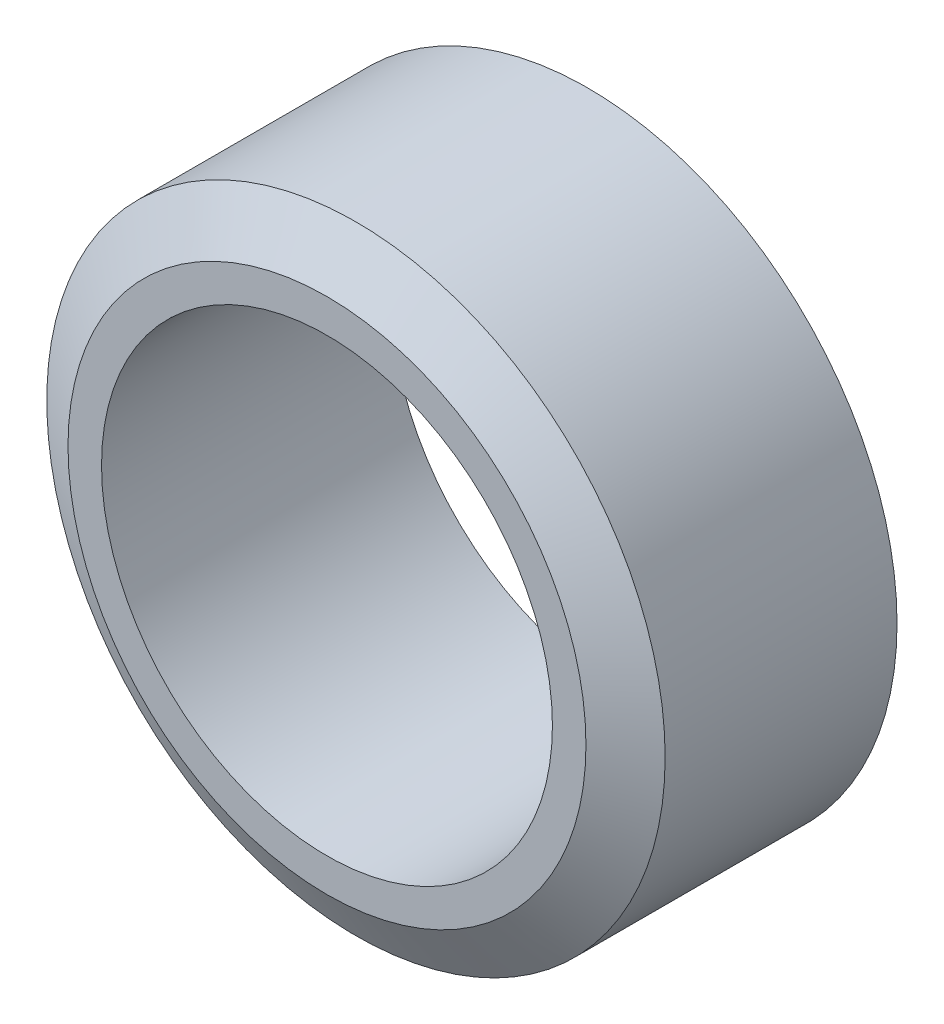
ISO-10303-21;
HEADER;
FILE_DESCRIPTION(('STEP AP214'),'2;1');
FILE_NAME('part.step','',(''),(''),'','','');
FILE_SCHEMA(('AUTOMOTIVE_DESIGN { 1 0 10303 214 1 1 1 1 }'));
ENDSEC;
DATA;
#1=APPLICATION_CONTEXT('core data for automotive mechanical design processes');
#2=APPLICATION_PROTOCOL_DEFINITION('international standard','automotive_design',2000,#1);
#3=PRODUCT_CONTEXT('',#1,'mechanical');
#4=PRODUCT('Part','Part','',(#3));
#5=PRODUCT_RELATED_PRODUCT_CATEGORY('part','',(#4));
#6=PRODUCT_DEFINITION_FORMATION('','',#4);
#7=PRODUCT_DEFINITION_CONTEXT('part definition',#1,'design');
#8=PRODUCT_DEFINITION('design','',#6,#7);
#9=PRODUCT_DEFINITION_SHAPE('','',#8);
#10=(LENGTH_UNIT() NAMED_UNIT(*) SI_UNIT(.MILLI.,.METRE.));
#11=(NAMED_UNIT(*) PLANE_ANGLE_UNIT() SI_UNIT($,.RADIAN.));
#12=(NAMED_UNIT(*) SI_UNIT($,.STERADIAN.) SOLID_ANGLE_UNIT());
#13=UNCERTAINTY_MEASURE_WITH_UNIT(LENGTH_MEASURE(1.E-05),#10,'distance_accuracy_value','');
#14=(GEOMETRIC_REPRESENTATION_CONTEXT(3) GLOBAL_UNCERTAINTY_ASSIGNED_CONTEXT((#13)) GLOBAL_UNIT_ASSIGNED_CONTEXT((#10,
#11,#12)) REPRESENTATION_CONTEXT('',''));
#15=CARTESIAN_POINT('',(0.,0.,0.));
#16=DIRECTION('',(0.,0.,1.));
#17=DIRECTION('',(1.,0.,0.));
#18=AXIS2_PLACEMENT_3D('',#15,#16,#17);
#19=CARTESIAN_POINT('',(0.,0.,9.));
#20=DIRECTION('',(0.,0.,1.));
#21=DIRECTION('',(1.,0.,0.));
#22=AXIS2_PLACEMENT_3D('',#19,#20,#21);
#23=PLANE('',#22);
#24=CARTESIAN_POINT('',(0.,0.,9.));
#25=DIRECTION('',(0.,0.,1.));
#26=DIRECTION('',(1.,0.,0.));
#27=AXIS2_PLACEMENT_3D('',#24,#25,#26);
#28=CIRCLE('',#27,8.041154273188);
#29=CARTESIAN_POINT('',(8.041154273188,0.,9.));
#30=VERTEX_POINT('',#29);
#31=EDGE_CURVE('E46',#30,#30,#28,.T.);
#32=ORIENTED_EDGE('',*,*,#31,.T.);
#33=EDGE_LOOP('',(#32));
#34=FACE_BOUND('',#33,.T.);
#35=CARTESIAN_POINT('',(0.,0.,9.));
#36=DIRECTION('',(0.,0.,1.));
#37=DIRECTION('',(1.,0.,0.));
#38=AXIS2_PLACEMENT_3D('',#35,#36,#37);
#39=CIRCLE('',#38,7.);
#40=CARTESIAN_POINT('',(7.,0.,9.));
#41=VERTEX_POINT('',#40);
#42=EDGE_CURVE('E51',#41,#41,#39,.T.);
#43=ORIENTED_EDGE('',*,*,#42,.F.);
#44=EDGE_LOOP('',(#43));
#45=FACE_BOUND('',#44,.T.);
#46=ADVANCED_FACE('F31',(#34,#45),#23,.T.);
#47=CARTESIAN_POINT('',(0.,0.,0.));
#48=DIRECTION('',(0.,0.,1.));
#49=DIRECTION('',(1.,0.,0.));
#50=AXIS2_PLACEMENT_3D('',#47,#48,#49);
#51=PLANE('',#50);
#52=CARTESIAN_POINT('',(0.,0.,0.));
#53=DIRECTION('',(0.,0.,1.));
#54=DIRECTION('',(1.,0.,0.));
#55=AXIS2_PLACEMENT_3D('',#52,#53,#54);
#56=CIRCLE('',#55,8.04115427318801);
#57=CARTESIAN_POINT('',(8.04115427318801,0.,0.));
#58=VERTEX_POINT('',#57);
#59=EDGE_CURVE('E10',#58,#58,#56,.F.);
#60=ORIENTED_EDGE('',*,*,#59,.T.);
#61=EDGE_LOOP('',(#60));
#62=FACE_BOUND('',#61,.T.);
#63=CARTESIAN_POINT('',(0.,0.,0.));
#64=DIRECTION('',(0.,0.,1.));
#65=DIRECTION('',(1.,0.,0.));
#66=AXIS2_PLACEMENT_3D('',#63,#64,#65);
#67=CIRCLE('',#66,7.);
#68=CARTESIAN_POINT('',(7.,0.,0.));
#69=VERTEX_POINT('',#68);
#70=EDGE_CURVE('E52',#69,#69,#67,.T.);
#71=ORIENTED_EDGE('',*,*,#70,.T.);
#72=EDGE_LOOP('',(#71));
#73=FACE_BOUND('',#72,.T.);
#74=ADVANCED_FACE('F62',(#62,#73),#51,.F.);
#75=CARTESIAN_POINT('',(0.,0.,9.));
#76=DIRECTION('',(0.,0.,-1.));
#77=DIRECTION('',(-1.,0.,0.));
#78=AXIS2_PLACEMENT_3D('',#75,#76,#77);
#79=CYLINDRICAL_SURFACE('',#78,9.6);
#80=CARTESIAN_POINT('',(0.,0.,0.900000000000003));
#81=DIRECTION('',(0.,0.,1.));
#82=DIRECTION('',(1.,0.,0.));
#83=AXIS2_PLACEMENT_3D('',#80,#81,#82);
#84=CIRCLE('',#83,9.6);
#85=CARTESIAN_POINT('',(9.6,0.,0.900000000000003));
#86=VERTEX_POINT('',#85);
#87=EDGE_CURVE('E38',#86,#86,#84,.T.);
#88=ORIENTED_EDGE('',*,*,#87,.T.);
#89=EDGE_LOOP('',(#88));
#90=FACE_BOUND('',#89,.T.);
#91=CARTESIAN_POINT('',(0.,0.,8.1));
#92=DIRECTION('',(0.,0.,1.));
#93=DIRECTION('',(1.,0.,0.));
#94=AXIS2_PLACEMENT_3D('',#91,#92,#93);
#95=CIRCLE('',#94,9.6);
#96=CARTESIAN_POINT('',(9.6,0.,8.1));
#97=VERTEX_POINT('',#96);
#98=EDGE_CURVE('E42',#97,#97,#95,.F.);
#99=ORIENTED_EDGE('',*,*,#98,.T.);
#100=EDGE_LOOP('',(#99));
#101=FACE_BOUND('',#100,.T.);
#102=ADVANCED_FACE('F68',(#90,#101),#79,.T.);
#103=CARTESIAN_POINT('',(0.,0.,9.));
#104=DIRECTION('',(0.,0.,-1.));
#105=DIRECTION('',(-1.,0.,0.));
#106=AXIS2_PLACEMENT_3D('',#103,#104,#105);
#107=CYLINDRICAL_SURFACE('',#106,7.);
#108=ORIENTED_EDGE('',*,*,#42,.T.);
#109=EDGE_LOOP('',(#108));
#110=FACE_BOUND('',#109,.T.);
#111=ORIENTED_EDGE('',*,*,#70,.F.);
#112=EDGE_LOOP('',(#111));
#113=FACE_BOUND('',#112,.T.);
#114=ADVANCED_FACE('F58',(#110,#113),#107,.F.);
#115=CARTESIAN_POINT('',(0.,0.,9.));
#116=DIRECTION('',(0.,0.,-1.));
#117=DIRECTION('',(-1.,0.,0.));
#118=AXIS2_PLACEMENT_3D('',#115,#116,#117);
#119=CONICAL_SURFACE('',#118,8.041154273188,1.0471975511966);
#120=ORIENTED_EDGE('',*,*,#98,.F.);
#121=EDGE_LOOP('',(#120));
#122=FACE_BOUND('',#121,.T.);
#123=ORIENTED_EDGE('',*,*,#31,.F.);
#124=EDGE_LOOP('',(#123));
#125=FACE_BOUND('',#124,.T.);
#126=ADVANCED_FACE('F73',(#122,#125),#119,.T.);
#127=CARTESIAN_POINT('',(0.,0.,0.900000000000003));
#128=DIRECTION('',(0.,0.,1.));
#129=DIRECTION('',(1.,0.,0.));
#130=AXIS2_PLACEMENT_3D('',#127,#128,#129);
#131=CONICAL_SURFACE('',#130,9.6,1.0471975511966);
#132=ORIENTED_EDGE('',*,*,#59,.F.);
#133=EDGE_LOOP('',(#132));
#134=FACE_BOUND('',#133,.T.);
#135=ORIENTED_EDGE('',*,*,#87,.F.);
#136=EDGE_LOOP('',(#135));
#137=FACE_BOUND('',#136,.T.);
#138=ADVANCED_FACE('F33',(#134,#137),#131,.T.);
#139=CLOSED_SHELL('',(#46,#74,#102,#114,#126,#138));
#140=MANIFOLD_SOLID_BREP('B2',#139);
#141=ADVANCED_BREP_SHAPE_REPRESENTATION('',(#18,#140),#14);
#142=SHAPE_DEFINITION_REPRESENTATION(#9,#141);
ENDSEC;
END-ISO-10303-21;
